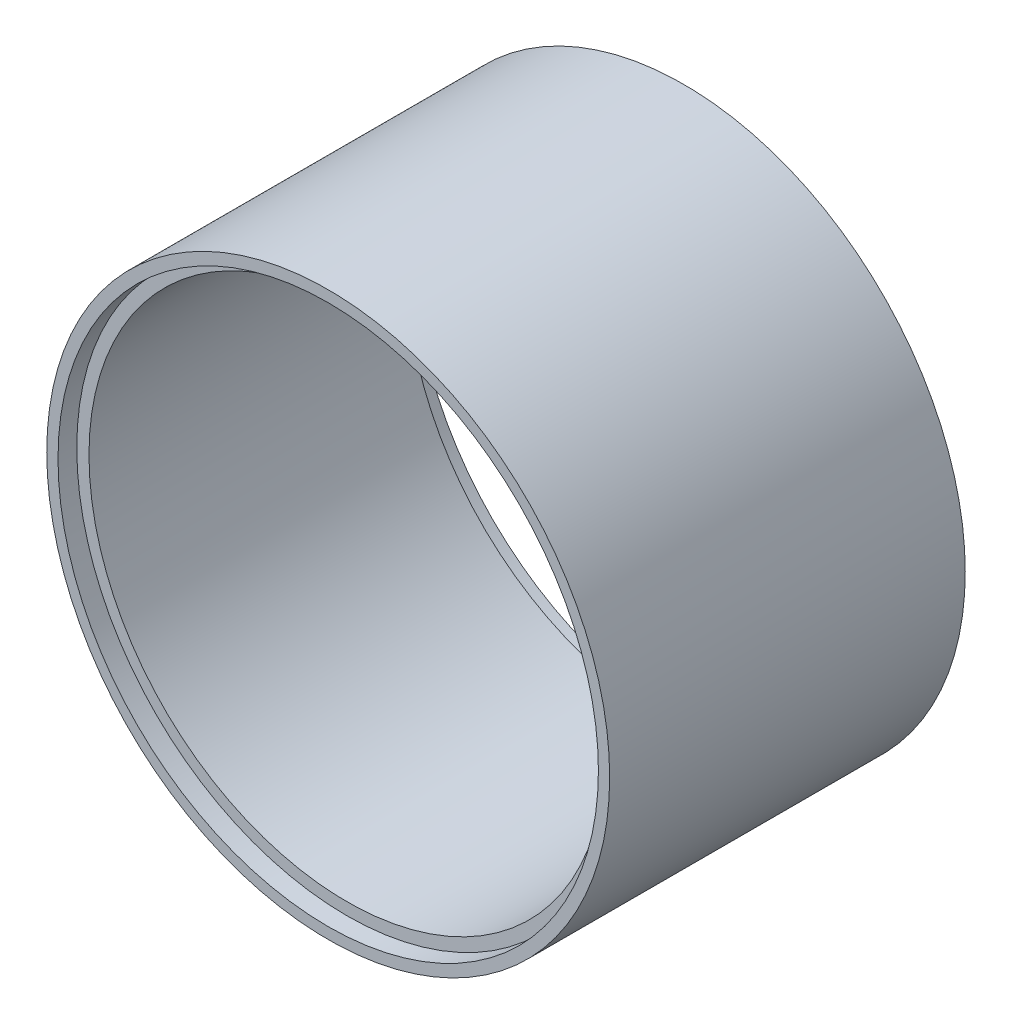
ISO-10303-21;
HEADER;
FILE_DESCRIPTION(('STEP AP214'),'2;1');
FILE_NAME('part.step','',(''),(''),'','','');
FILE_SCHEMA(('AUTOMOTIVE_DESIGN { 1 0 10303 214 1 1 1 1 }'));
ENDSEC;
DATA;
#1=APPLICATION_CONTEXT('core data for automotive mechanical design processes');
#2=APPLICATION_PROTOCOL_DEFINITION('international standard','automotive_design',2000,#1);
#3=PRODUCT_CONTEXT('',#1,'mechanical');
#4=PRODUCT('Part','Part','',(#3));
#5=PRODUCT_RELATED_PRODUCT_CATEGORY('part','',(#4));
#6=PRODUCT_DEFINITION_FORMATION('','',#4);
#7=PRODUCT_DEFINITION_CONTEXT('part definition',#1,'design');
#8=PRODUCT_DEFINITION('design','',#6,#7);
#9=PRODUCT_DEFINITION_SHAPE('','',#8);
#10=(LENGTH_UNIT() NAMED_UNIT(*) SI_UNIT(.MILLI.,.METRE.));
#11=(NAMED_UNIT(*) PLANE_ANGLE_UNIT() SI_UNIT($,.RADIAN.));
#12=(NAMED_UNIT(*) SI_UNIT($,.STERADIAN.) SOLID_ANGLE_UNIT());
#13=UNCERTAINTY_MEASURE_WITH_UNIT(LENGTH_MEASURE(1.E-05),#10,'distance_accuracy_value','');
#14=(GEOMETRIC_REPRESENTATION_CONTEXT(3) GLOBAL_UNCERTAINTY_ASSIGNED_CONTEXT((#13)) GLOBAL_UNIT_ASSIGNED_CONTEXT((#10,
#11,#12)) REPRESENTATION_CONTEXT('',''));
#15=CARTESIAN_POINT('',(0.,0.,0.));
#16=DIRECTION('',(0.,0.,1.));
#17=DIRECTION('',(1.,0.,0.));
#18=AXIS2_PLACEMENT_3D('',#15,#16,#17);
#19=CARTESIAN_POINT('',(0.,-108.5,-39.9));
#20=DIRECTION('',(0.,0.,1.));
#21=DIRECTION('',(1.,0.,0.));
#22=AXIS2_PLACEMENT_3D('',#19,#20,#21);
#23=CYLINDRICAL_SURFACE('',#22,27.5);
#24=CARTESIAN_POINT('',(-0.404751588248596,-81.0029787767509,-21.620402969892));
#25=CARTESIAN_POINT('',(-0.442080569416745,-81.0035283061411,-21.5982650364205));
#26=CARTESIAN_POINT('',(-0.477603810587563,-81.0041277142822,-21.5730304610189));
#27=CARTESIAN_POINT('',(-0.544029265821869,-81.0053615963922,-21.5170288222509));
#28=CARTESIAN_POINT('',(-0.574926527064146,-81.0059961069628,-21.4862559057467));
#29=CARTESIAN_POINT('',(-0.631707680982607,-81.0072415388204,-21.4194100154996));
#30=CARTESIAN_POINT('',(-0.657490948074429,-81.0078518270808,-21.3832513552277));
#31=CARTESIAN_POINT('',(-0.702553179497333,-81.0089663809304,-21.3070933623816));
#32=CARTESIAN_POINT('',(-0.721833417015047,-81.0094706672657,-21.2670947835729));
#33=CARTESIAN_POINT('',(-0.75317641088899,-81.0103115630562,-21.1847588561043));
#34=CARTESIAN_POINT('',(-0.765300315419261,-81.0106495888687,-21.1424448008707));
#35=CARTESIAN_POINT('',(-0.782223021220802,-81.0111258897182,-21.056374923051));
#36=CARTESIAN_POINT('',(-0.787021991472249,-81.0112641693633,-21.0126191337481));
#37=CARTESIAN_POINT('',(-0.789142319741031,-81.0113249597641,-20.9252108753391));
#38=CARTESIAN_POINT('',(-0.786511830814845,-81.0112488599998,-20.8815595677727));
#39=CARTESIAN_POINT('',(-0.7739561046739,-81.0108925074073,-20.7953206648635));
#40=CARTESIAN_POINT('',(-0.764030956375797,-81.0106122570675,-20.7527330565614));
#41=CARTESIAN_POINT('',(-0.73719270646076,-81.0098794919823,-20.6698564906362));
#42=CARTESIAN_POINT('',(-0.720284608034961,-81.0094271005918,-20.6295659106965));
#43=CARTESIAN_POINT('',(-0.679980273761706,-81.0084007136613,-20.5523751688495));
#44=CARTESIAN_POINT('',(-0.656583905633967,-81.007826715642,-20.5154750760865));
#45=CARTESIAN_POINT('',(-0.603841204824809,-81.006617648928,-20.4458940091071));
#46=CARTESIAN_POINT('',(-0.57446363360655,-81.0059822692032,-20.4132367247913));
#47=CARTESIAN_POINT('',(-0.510684120655662,-81.0047237332151,-20.3532662371636));
#48=CARTESIAN_POINT('',(-0.476281957664802,-81.0041005774916,-20.325953269313));
#49=CARTESIAN_POINT('',(-0.403112765216771,-81.0029301902394,-20.2771957027757));
#50=CARTESIAN_POINT('',(-0.364310693764731,-81.0023836588618,-20.2558036736612));
#51=CARTESIAN_POINT('',(-0.283685345217998,-81.0014337360358,-20.2197775237128));
#52=CARTESIAN_POINT('',(-0.241861934472325,-81.0010303509242,-20.2051437020446));
#53=CARTESIAN_POINT('',(-0.156027952249639,-81.0004089067328,-20.1829363710565));
#54=CARTESIAN_POINT('',(-0.112002777373109,-81.0001923287543,-20.1754192415147));
#55=CARTESIAN_POINT('',(-0.0233143516431199,-80.9999741326375,-20.1678467878491));
#56=CARTESIAN_POINT('',(0.021348917853174,-80.9999725207927,-20.1677916821866));
#57=CARTESIAN_POINT('',(0.110236618530658,-81.0001848859766,-20.1751601576659));
#58=CARTESIAN_POINT('',(0.154458545925716,-81.0003997345237,-20.1826139713997));
#59=CARTESIAN_POINT('',(0.241021077500363,-81.0010221396044,-20.2048451183773));
#60=CARTESIAN_POINT('',(0.283361675037328,-81.0014296968182,-20.219622477477));
#61=CARTESIAN_POINT('',(0.364902404649033,-81.0023908569588,-20.2560785172691));
#62=CARTESIAN_POINT('',(0.404105979350236,-81.0029442968444,-20.2777494990798));
#63=CARTESIAN_POINT('',(0.478288734142568,-81.0041345262405,-20.3274025484331));
#64=CARTESIAN_POINT('',(0.513268023736285,-81.0047713135896,-20.3553844523289));
#65=CARTESIAN_POINT('',(0.577779154988005,-81.0060514234127,-20.4166943241383));
#66=CARTESIAN_POINT('',(0.607342265356262,-81.0066946841928,-20.4499893853677));
#67=CARTESIAN_POINT('',(0.660400139243245,-81.007917900627,-20.5211085425273));
#68=CARTESIAN_POINT('',(0.683895196111264,-81.0084978593405,-20.5589324193905));
#69=CARTESIAN_POINT('',(0.723932875464304,-81.0095230919049,-20.6376825183666));
#70=CARTESIAN_POINT('',(0.740534336820577,-81.0099694961119,-20.678578811864));
#71=CARTESIAN_POINT('',(0.766577616166014,-81.0106833491224,-20.7625922257457));
#72=CARTESIAN_POINT('',(0.776019778650756,-81.0109508065365,-20.8057092391654));
#73=CARTESIAN_POINT('',(0.787413576835198,-81.0112748101945,-20.8925858476942));
#74=CARTESIAN_POINT('',(0.78942200676076,-81.0113329555029,-20.9363379958876));
#75=CARTESIAN_POINT('',(0.786045679842957,-81.0112362062712,-21.0235551094908));
#76=CARTESIAN_POINT('',(0.780661104103339,-81.0110813169497,-21.0670200819093));
#77=CARTESIAN_POINT('',(0.76268604449265,-81.0105767692993,-21.1523073735658));
#78=CARTESIAN_POINT('',(0.750115209502963,-81.0102276421308,-21.1941338409932));
#79=CARTESIAN_POINT('',(0.71815650105917,-81.0093742310214,-21.2750932083018));
#80=CARTESIAN_POINT('',(0.698768535254935,-81.0088699449785,-21.3142260716847));
#81=CARTESIAN_POINT('',(0.653662045325777,-81.0077604646039,-21.3888474639687));
#82=CARTESIAN_POINT('',(0.627920746197351,-81.0071549098259,-21.4243222162));
#83=CARTESIAN_POINT('',(0.570891416952238,-81.0059116477762,-21.4904895698701));
#84=CARTESIAN_POINT('',(0.539603160918133,-81.0052739391957,-21.521181976437));
#85=CARTESIAN_POINT('',(0.472100981131146,-81.0040318047321,-21.5771794917516));
#86=CARTESIAN_POINT('',(0.435849484372407,-81.003427687597,-21.6024393117133));
#87=CARTESIAN_POINT('',(0.359649150558439,-81.0023255049165,-21.6465743299295));
#88=CARTESIAN_POINT('',(0.319700278738428,-81.0018274403685,-21.665449468144));
#89=CARTESIAN_POINT('',(0.236877428162715,-81.0009888012886,-21.6964435553525));
#90=CARTESIAN_POINT('',(0.19398169965796,-81.0006495846429,-21.7085044279232));
#91=CARTESIAN_POINT('',(0.106766766051303,-81.0001726909585,-21.7253022357637));
#92=CARTESIAN_POINT('',(0.0624471835012326,-81.000035067818,-21.7300372123902));
#93=CARTESIAN_POINT('',(-0.0266209724994046,-80.9999765998226,-21.7320593270787));
#94=CARTESIAN_POINT('',(-0.071370533149702,-81.000057041251,-21.729302272148));
#95=CARTESIAN_POINT('',(-0.159737158153436,-81.0004285132332,-21.7163186168911));
#96=CARTESIAN_POINT('',(-0.203355425655521,-81.0007193096864,-21.7061003199398));
#97=CARTESIAN_POINT('',(-0.273498199273607,-81.0013459898355,-21.6832919228183));
#98=CARTESIAN_POINT('',(-0.300707549159729,-81.0016313138992,-21.6727513744924));
#99=CARTESIAN_POINT('',(-0.353799886960399,-81.0022631874701,-21.6487403204259));
#100=CARTESIAN_POINT('',(-0.379682925885908,-81.0026097346203,-21.635269927474));
#101=CARTESIAN_POINT('',(-0.404751588248596,-81.0029787767509,-21.620402969892));
#102=B_SPLINE_CURVE_WITH_KNOTS('',3,(#24,#25,#26,#27,#28,#29,#30,#31,#32,#33,#34,#35,#36,#37,
#38,#39,#40,#41,#42,#43,#44,#45,#46,#47,#48,#49,#50,#51,#52,#53,#54,#55,#56,#57,#58,#59,#60,#61,
#62,#63,#64,#65,#66,#67,#68,#69,#70,#71,#72,#73,#74,#75,#76,#77,#78,#79,#80,#81,#82,#83,#84,#85,
#86,#87,#88,#89,#90,#91,#92,#93,#94,#95,#96,#97,#98,#99,#100,#101),.UNSPECIFIED.,.T.,.F.,(4,2,2,
2,2,2,2,2,2,2,2,2,2,2,2,2,2,2,2,2,2,2,2,2,2,2,2,2,2,2,2,2,2,2,2,2,2,2,4),(0.,0.130107818200116,
0.260353955672272,0.392952478337684,0.525525025295492,0.656947746722074,0.788367436289333,
0.918937304884158,1.04950558195251,1.1799804704338,1.31045801918124,1.44163536018456,
1.57281847933335,1.70513146067723,1.83745029856331,1.97080882949187,2.10417126467843,
2.23807280146222,2.37197481098962,2.50572779906969,2.63947731923904,2.77242851061247,
2.9053732734926,3.03715875458683,3.16893789394315,3.29970812864083,3.43047515996522,
3.56088634277053,3.6912992922947,3.82218670589283,3.9530794515213,4.08502437239543,
4.21697053401532,4.35002490542871,4.48311484396127,4.61699153705275,4.7507194697355,
4.83809808032368,4.92547332773568),.UNSPECIFIED.);
#103=CARTESIAN_POINT('',(-0.404751588248596,-81.0029787767509,-21.620402969892));
#104=VERTEX_POINT('',#103);
#105=EDGE_CURVE('E75',#104,#104,#102,.T.);
#106=ORIENTED_EDGE('',*,*,#105,.T.);
#107=EDGE_LOOP('',(#106));
#108=FACE_BOUND('',#107,.T.);
#109=CARTESIAN_POINT('',(0.,-108.5,-4.));
#110=DIRECTION('',(0.,0.,1.));
#111=DIRECTION('',(1.,0.,0.));
#112=AXIS2_PLACEMENT_3D('',#109,#110,#111);
#113=CIRCLE('',#112,27.5);
#114=CARTESIAN_POINT('',(27.5,-108.5,-4.));
#115=VERTEX_POINT('',#114);
#116=EDGE_CURVE('E61',#115,#115,#113,.F.);
#117=ORIENTED_EDGE('',*,*,#116,.F.);
#118=EDGE_LOOP('',(#117));
#119=FACE_BOUND('',#118,.T.);
#120=CARTESIAN_POINT('',(0.,-108.5,-37.9));
#121=DIRECTION('',(0.,0.,-1.));
#122=DIRECTION('',(-1.,0.,0.));
#123=AXIS2_PLACEMENT_3D('',#120,#121,#122);
#124=CIRCLE('',#123,27.5);
#125=CARTESIAN_POINT('',(-27.5,-108.5,-37.9));
#126=VERTEX_POINT('',#125);
#127=EDGE_CURVE('E71',#126,#126,#124,.F.);
#128=ORIENTED_EDGE('',*,*,#127,.F.);
#129=EDGE_LOOP('',(#128));
#130=FACE_BOUND('',#129,.T.);
#131=ADVANCED_FACE('F40',(#108,#119,#130),#23,.F.);
#132=CARTESIAN_POINT('',(0.,-108.5,-39.9));
#133=DIRECTION('',(0.,0.,1.));
#134=DIRECTION('',(1.,0.,0.));
#135=AXIS2_PLACEMENT_3D('',#132,#133,#134);
#136=CYLINDRICAL_SURFACE('',#135,30.);
#137=CARTESIAN_POINT('',(0.,-108.5,-39.9));
#138=DIRECTION('',(0.,0.,1.));
#139=DIRECTION('',(1.,0.,0.));
#140=AXIS2_PLACEMENT_3D('',#137,#138,#139);
#141=CIRCLE('',#140,30.);
#142=CARTESIAN_POINT('',(30.,-108.5,-39.9));
#143=VERTEX_POINT('',#142);
#144=EDGE_CURVE('E10',#143,#143,#141,.T.);
#145=ORIENTED_EDGE('',*,*,#144,.T.);
#146=EDGE_LOOP('',(#145));
#147=FACE_BOUND('',#146,.T.);
#148=CARTESIAN_POINT('',(0.,-108.5,-2.));
#149=DIRECTION('',(0.,0.,1.));
#150=DIRECTION('',(1.,0.,0.));
#151=AXIS2_PLACEMENT_3D('',#148,#149,#150);
#152=CIRCLE('',#151,30.);
#153=CARTESIAN_POINT('',(30.,-108.5,-2.));
#154=VERTEX_POINT('',#153);
#155=EDGE_CURVE('E54',#154,#154,#152,.T.);
#156=ORIENTED_EDGE('',*,*,#155,.F.);
#157=EDGE_LOOP('',(#156));
#158=FACE_BOUND('',#157,.T.);
#159=ADVANCED_FACE('F42',(#147,#158),#136,.T.);
#160=CARTESIAN_POINT('',(0.,-108.5,-39.9));
#161=DIRECTION('',(0.,0.,1.));
#162=DIRECTION('',(1.,0.,0.));
#163=AXIS2_PLACEMENT_3D('',#160,#161,#162);
#164=PLANE('',#163);
#165=CARTESIAN_POINT('',(0.,-108.5,-39.9));
#166=DIRECTION('',(0.,0.,-1.));
#167=DIRECTION('',(-1.,0.,0.));
#168=AXIS2_PLACEMENT_3D('',#165,#166,#167);
#169=CIRCLE('',#168,28.8);
#170=CARTESIAN_POINT('',(-28.8,-108.5,-39.9));
#171=VERTEX_POINT('',#170);
#172=EDGE_CURVE('E81',#171,#171,#169,.T.);
#173=ORIENTED_EDGE('',*,*,#172,.F.);
#174=EDGE_LOOP('',(#173));
#175=FACE_BOUND('',#174,.T.);
#176=ORIENTED_EDGE('',*,*,#144,.F.);
#177=EDGE_LOOP('',(#176));
#178=FACE_BOUND('',#177,.T.);
#179=ADVANCED_FACE('F117',(#175,#178),#164,.F.);
#180=CARTESIAN_POINT('',(0.,-108.5,-2.));
#181=DIRECTION('',(0.,0.,1.));
#182=DIRECTION('',(1.,0.,0.));
#183=AXIS2_PLACEMENT_3D('',#180,#181,#182);
#184=PLANE('',#183);
#185=CARTESIAN_POINT('',(0.,-108.5,-2.));
#186=DIRECTION('',(0.,0.,1.));
#187=DIRECTION('',(1.,0.,0.));
#188=AXIS2_PLACEMENT_3D('',#185,#186,#187);
#189=CIRCLE('',#188,28.8);
#190=CARTESIAN_POINT('',(28.8,-108.5,-2.));
#191=VERTEX_POINT('',#190);
#192=EDGE_CURVE('E64',#191,#191,#189,.T.);
#193=ORIENTED_EDGE('',*,*,#192,.F.);
#194=EDGE_LOOP('',(#193));
#195=FACE_BOUND('',#194,.T.);
#196=ORIENTED_EDGE('',*,*,#155,.T.);
#197=EDGE_LOOP('',(#196));
#198=FACE_BOUND('',#197,.T.);
#199=ADVANCED_FACE('F104',(#195,#198),#184,.T.);
#200=CARTESIAN_POINT('',(0.,-108.5,-4.));
#201=DIRECTION('',(0.,0.,1.));
#202=DIRECTION('',(1.,0.,0.));
#203=AXIS2_PLACEMENT_3D('',#200,#201,#202);
#204=PLANE('',#203);
#205=CARTESIAN_POINT('',(0.,-108.5,-4.));
#206=DIRECTION('',(0.,0.,1.));
#207=DIRECTION('',(1.,0.,0.));
#208=AXIS2_PLACEMENT_3D('',#205,#206,#207);
#209=CIRCLE('',#208,28.8);
#210=CARTESIAN_POINT('',(28.8,-108.5,-4.));
#211=VERTEX_POINT('',#210);
#212=EDGE_CURVE('E70',#211,#211,#209,.T.);
#213=ORIENTED_EDGE('',*,*,#212,.T.);
#214=EDGE_LOOP('',(#213));
#215=FACE_BOUND('',#214,.T.);
#216=ORIENTED_EDGE('',*,*,#116,.T.);
#217=EDGE_LOOP('',(#216));
#218=FACE_BOUND('',#217,.T.);
#219=ADVANCED_FACE('F102',(#215,#218),#204,.T.);
#220=CARTESIAN_POINT('',(0.,-108.5,-4.));
#221=DIRECTION('',(0.,0.,1.));
#222=DIRECTION('',(1.,0.,0.));
#223=AXIS2_PLACEMENT_3D('',#220,#221,#222);
#224=CYLINDRICAL_SURFACE('',#223,28.8);
#225=ORIENTED_EDGE('',*,*,#212,.F.);
#226=EDGE_LOOP('',(#225));
#227=FACE_BOUND('',#226,.T.);
#228=ORIENTED_EDGE('',*,*,#192,.T.);
#229=EDGE_LOOP('',(#228));
#230=FACE_BOUND('',#229,.T.);
#231=ADVANCED_FACE('F97',(#227,#230),#224,.F.);
#232=CARTESIAN_POINT('',(0.,-108.5,-37.9));
#233=DIRECTION('',(0.,0.,-1.));
#234=DIRECTION('',(-1.,0.,0.));
#235=AXIS2_PLACEMENT_3D('',#232,#233,#234);
#236=PLANE('',#235);
#237=CARTESIAN_POINT('',(0.,-108.5,-37.9));
#238=DIRECTION('',(0.,0.,-1.));
#239=DIRECTION('',(-1.,0.,0.));
#240=AXIS2_PLACEMENT_3D('',#237,#238,#239);
#241=CIRCLE('',#240,28.8);
#242=CARTESIAN_POINT('',(-28.8,-108.5,-37.9));
#243=VERTEX_POINT('',#242);
#244=EDGE_CURVE('E74',#243,#243,#241,.T.);
#245=ORIENTED_EDGE('',*,*,#244,.T.);
#246=EDGE_LOOP('',(#245));
#247=FACE_BOUND('',#246,.T.);
#248=ORIENTED_EDGE('',*,*,#127,.T.);
#249=EDGE_LOOP('',(#248));
#250=FACE_BOUND('',#249,.T.);
#251=ADVANCED_FACE('F93',(#247,#250),#236,.T.);
#252=CARTESIAN_POINT('',(0.,-108.5,-37.9));
#253=DIRECTION('',(0.,0.,-1.));
#254=DIRECTION('',(-1.,0.,0.));
#255=AXIS2_PLACEMENT_3D('',#252,#253,#254);
#256=CYLINDRICAL_SURFACE('',#255,28.8);
#257=ORIENTED_EDGE('',*,*,#244,.F.);
#258=EDGE_LOOP('',(#257));
#259=FACE_BOUND('',#258,.T.);
#260=ORIENTED_EDGE('',*,*,#172,.T.);
#261=EDGE_LOOP('',(#260));
#262=FACE_BOUND('',#261,.T.);
#263=ADVANCED_FACE('F90',(#259,#262),#256,.F.);
#264=CARTESIAN_POINT('',(0.,-79.75,-20.95));
#265=DIRECTION('',(0.,-1.,0.));
#266=DIRECTION('',(0.,0.,-1.));
#267=AXIS2_PLACEMENT_3D('',#264,#265,#266);
#268=CONICAL_SURFACE('',#267,0.,0.558599315343562);
#269=CARTESIAN_POINT('',(-0.906268854350636,-82.5157994780745,-22.4220122372087));
#270=CARTESIAN_POINT('',(-0.823854852043215,-82.512925587284,-22.4706380955749));
#271=CARTESIAN_POINT('',(-0.737422582260914,-82.5103064665732,-22.5125777802232));
#272=CARTESIAN_POINT('',(-0.558854706498013,-82.5058531094977,-22.5820441315081));
#273=CARTESIAN_POINT('',(-0.466712643590948,-82.5040197809951,-22.6095541350313));
#274=CARTESIAN_POINT('',(-0.27529580564412,-82.5012743599828,-22.6502976671281));
#275=CARTESIAN_POINT('',(-0.175883672836996,-82.500403567642,-22.662892709375));
#276=CARTESIAN_POINT('',(0.0236373832776109,-82.4998193071936,-22.6713735880345));
#277=CARTESIAN_POINT('',(0.123746241372709,-82.5001057321887,-22.6672609678073));
#278=CARTESIAN_POINT('',(0.322552467917129,-82.5018095154577,-22.6423512040294));
#279=CARTESIAN_POINT('',(0.421235654800633,-82.5032345322902,-22.6214410694838));
#280=CARTESIAN_POINT('',(0.613667318524769,-82.5070647969279,-22.5633235266584));
#281=CARTESIAN_POINT('',(0.707415667465142,-82.5094700701252,-22.5261156962105));
#282=CARTESIAN_POINT('',(0.886924555565567,-82.5149772219905,-22.4365246764725));
#283=CARTESIAN_POINT('',(0.972712254750522,-82.5180765988817,-22.384195796492));
#284=CARTESIAN_POINT('',(1.1341129045897,-82.5246208561342,-22.2656899762151));
#285=CARTESIAN_POINT('',(1.20972646942322,-82.528065715618,-22.1995138724472));
#286=CARTESIAN_POINT('',(1.34746504910545,-82.5348495364317,-22.0561314541507));
#287=CARTESIAN_POINT('',(1.40976350693207,-82.5381893046561,-21.9790918803778));
#288=CARTESIAN_POINT('',(1.52021484801013,-82.5444222127808,-21.8154450916052));
#289=CARTESIAN_POINT('',(1.56836952744003,-82.5473154093711,-21.7288390934105));
#290=CARTESIAN_POINT('',(1.64809259941698,-82.5522571189783,-21.5504743381818));
#291=CARTESIAN_POINT('',(1.67998960997022,-82.5543221710233,-21.4588629144435));
#292=CARTESIAN_POINT('',(1.72765317293969,-82.5574520866756,-21.2715208496972));
#293=CARTESIAN_POINT('',(1.74342170650262,-82.5585170731251,-21.175790716118));
#294=CARTESIAN_POINT('',(1.75816183862714,-82.5595119475519,-20.9848234270712));
#295=CARTESIAN_POINT('',(1.75743803230883,-82.5594624195806,-20.8896097740545));
#296=CARTESIAN_POINT('',(1.73996721953427,-82.558284771532,-20.7006750375485));
#297=CARTESIAN_POINT('',(1.72322092970871,-82.5571566996944,-20.6069538874952));
#298=CARTESIAN_POINT('',(1.67436679012316,-82.5539581921964,-20.4240962970945));
#299=CARTESIAN_POINT('',(1.64233058945098,-82.551892154061,-20.3349405988612));
#300=CARTESIAN_POINT('',(1.56393489223741,-82.5470494591158,-20.1631921976369));
#301=CARTESIAN_POINT('',(1.51757471463285,-82.5442727685176,-20.0805998069467));
#302=CARTESIAN_POINT('',(1.41130153931856,-82.5382765617339,-19.9232310501259));
#303=CARTESIAN_POINT('',(1.35123357448103,-82.5350521614563,-19.8485595899289));
#304=CARTESIAN_POINT('',(1.21964293939806,-82.5285387024255,-19.7101113425025));
#305=CARTESIAN_POINT('',(1.14811912361101,-82.5252496372349,-19.6463356461274));
#306=CARTESIAN_POINT('',(0.994051193335378,-82.5188930569667,-19.5300723747419));
#307=CARTESIAN_POINT('',(0.911308726101114,-82.5158315764362,-19.4778473138588));
#308=CARTESIAN_POINT('',(0.738342150714717,-82.5103418183814,-19.3877186965392));
#309=CARTESIAN_POINT('',(0.648117292597964,-82.5079136044311,-19.3498165778207));
#310=CARTESIAN_POINT('',(0.460922550640669,-82.5039143434624,-19.288693267293));
#311=CARTESIAN_POINT('',(0.36385776898482,-82.5023602638677,-19.2657613789171));
#312=CARTESIAN_POINT('',(0.167257528782039,-82.50035214783,-19.2363009290997));
#313=CARTESIAN_POINT('',(0.0677219049307118,-82.4998981851885,-19.2297734681509));
#314=CARTESIAN_POINT('',(-0.132067272170176,-82.5001416163023,-19.233303789233));
#315=CARTESIAN_POINT('',(-0.232317878323186,-82.5008507249603,-19.2435303227503));
#316=CARTESIAN_POINT('',(-0.429679515861077,-82.503363297225,-19.2806320384692));
#317=CARTESIAN_POINT('',(-0.526790475314841,-82.505166785886,-19.3075076018256));
#318=CARTESIAN_POINT('',(-0.715069004087899,-82.5096643192151,-19.3772156432037));
#319=CARTESIAN_POINT('',(-0.806237678344213,-82.512358197751,-19.4200451446706));
#320=CARTESIAN_POINT('',(-0.979973870276397,-82.5183292389102,-19.5205490886341));
#321=CARTESIAN_POINT('',(-1.0625417170323,-82.521606379204,-19.5782229628703));
#322=CARTESIAN_POINT('',(-1.21574329517707,-82.5283270393351,-19.7061783647791));
#323=CARTESIAN_POINT('',(-1.28649550577934,-82.5317683981869,-19.7763180642206));
#324=CARTESIAN_POINT('',(-1.41493175809432,-82.5384492919936,-19.9276993283815));
#325=CARTESIAN_POINT('',(-1.47261720173346,-82.5416888485727,-20.0089397006149));
#326=CARTESIAN_POINT('',(-1.57206366102981,-82.547523072406,-20.1785271518931));
#327=CARTESIAN_POINT('',(-1.61411439623116,-82.5501291259308,-20.2667039100165));
#328=CARTESIAN_POINT('',(-1.68247966900466,-82.5544715829532,-20.4489802793228));
#329=CARTESIAN_POINT('',(-1.70879628862964,-82.5562081015092,-20.5430791050324));
#330=CARTESIAN_POINT('',(-1.74443571210387,-82.5585802407173,-20.7324394008235));
#331=CARTESIAN_POINT('',(-1.75409805670902,-82.5592378440983,-20.8276367870709));
#332=CARTESIAN_POINT('',(-1.75716246635574,-82.5594451952838,-21.0182874618504));
#333=CARTESIAN_POINT('',(-1.75056629585105,-82.5589950633053,-21.1137407214908));
#334=CARTESIAN_POINT('',(-1.72148374888482,-82.5570491448793,-21.3011993944966));
#335=CARTESIAN_POINT('',(-1.69915664964185,-82.5555638412653,-21.3932297136487));
#336=CARTESIAN_POINT('',(-1.6394931676871,-82.5517255203604,-21.5722885218495));
#337=CARTESIAN_POINT('',(-1.60215333544882,-82.5493723036564,-21.6593158560889));
#338=CARTESIAN_POINT('',(-1.51329982422668,-82.544038985324,-21.8266045408635));
#339=CARTESIAN_POINT('',(-1.46168246352081,-82.5410543371013,-21.9068105604188));
#340=CARTESIAN_POINT('',(-1.34598116204856,-82.5347988231305,-22.0575562490769));
#341=CARTESIAN_POINT('',(-1.28190863729291,-82.5315282209778,-22.1281046698767));
#342=CARTESIAN_POINT('',(-1.16589435055156,-82.526111667713,-22.2365637462955));
#343=CARTESIAN_POINT('',(-1.11683457830412,-82.5239475940636,-22.2776043951166));
#344=CARTESIAN_POINT('',(-1.0145364545183,-82.5197509832651,-22.3540941642063));
#345=CARTESIAN_POINT('',(-0.961298429896142,-82.5177184358479,-22.3895437212829));
#346=CARTESIAN_POINT('',(-0.906268854350636,-82.5157994780745,-22.4220122372087));
#347=B_SPLINE_CURVE_WITH_KNOTS('',3,(#269,#270,#271,#272,#273,#274,#275,#276,#277,#278,#279,
#280,#281,#282,#283,#284,#285,#286,#287,#288,#289,#290,#291,#292,#293,#294,#295,#296,#297,#298,
#299,#300,#301,#302,#303,#304,#305,#306,#307,#308,#309,#310,#311,#312,#313,#314,#315,#316,#317,
#318,#319,#320,#321,#322,#323,#324,#325,#326,#327,#328,#329,#330,#331,#332,#333,#334,#335,#336,
#337,#338,#339,#340,#341,#342,#343,#344,#345,#346),.UNSPECIFIED.,.T.,.F.,(4,2,2,2,2,2,2,2,2,2,2,
2,2,2,2,2,2,2,2,2,2,2,2,2,2,2,2,2,2,2,2,2,2,2,2,2,2,2,4),(0.,0.286982575765807,
0.574295827816264,0.87350886796998,1.1726942691289,1.47390920843248,1.77513195073174,
2.07528597907263,2.37542187995722,2.67137108827027,2.9672826964704,3.25694881511747,
3.54657934825841,3.83086513854036,4.11513821428918,4.39809206311595,4.68105936764059,
4.96739974843512,5.25376878007754,5.54609694315201,5.83845444195213,6.13630655328474,
6.43417864552537,6.73506948539795,7.0359672139752,7.33680883162073,7.63763893440206,
7.93524313030132,8.23281538126671,8.5245604166884,8.81626683773169,9.10195244684708,
9.38760705332505,9.67041018530783,9.95327833509386,10.2382571558868,10.5229759952875,
10.7146153211609,10.9062396676456),.UNSPECIFIED.);
#348=CARTESIAN_POINT('',(-0.906268854350636,-82.5157994780745,-22.4220122372087));
#349=VERTEX_POINT('',#348);
#350=EDGE_CURVE('E44',#349,#349,#347,.T.);
#351=ORIENTED_EDGE('',*,*,#350,.F.);
#352=EDGE_LOOP('',(#351));
#353=FACE_BOUND('',#352,.T.);
#354=ORIENTED_EDGE('',*,*,#105,.F.);
#355=EDGE_LOOP('',(#354));
#356=FACE_BOUND('',#355,.T.);
#357=ADVANCED_FACE('F85',(#353,#356),#268,.T.);
#358=CARTESIAN_POINT('',(0.,-108.5,-39.9));
#359=DIRECTION('',(0.,0.,1.));
#360=DIRECTION('',(1.,0.,0.));
#361=AXIS2_PLACEMENT_3D('',#358,#359,#360);
#362=CYLINDRICAL_SURFACE('',#361,26.);
#363=ORIENTED_EDGE('',*,*,#350,.T.);
#364=EDGE_LOOP('',(#363));
#365=FACE_BOUND('',#364,.T.);
#366=ADVANCED_FACE('F89',(#365),#362,.F.);
#367=CLOSED_SHELL('',(#131,#159,#179,#199,#219,#231,#251,#263,#357,#366));
#368=MANIFOLD_SOLID_BREP('B2',#367);
#369=ADVANCED_BREP_SHAPE_REPRESENTATION('',(#18,#368),#14);
#370=SHAPE_DEFINITION_REPRESENTATION(#9,#369);
ENDSEC;
END-ISO-10303-21;
